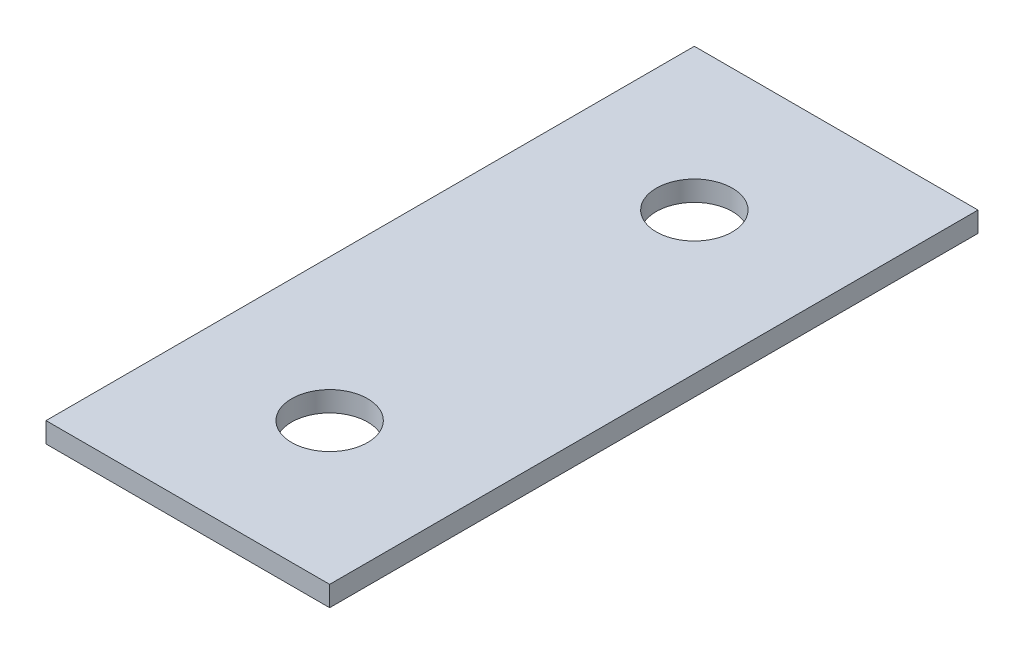
ISO-10303-21;
HEADER;
FILE_DESCRIPTION(('STEP AP214'),'2;1');
FILE_NAME('part.step','',(''),(''),'','','');
FILE_SCHEMA(('AUTOMOTIVE_DESIGN { 1 0 10303 214 1 1 1 1 }'));
ENDSEC;
DATA;
#1=APPLICATION_CONTEXT('core data for automotive mechanical design processes');
#2=APPLICATION_PROTOCOL_DEFINITION('international standard','automotive_design',2000,#1);
#3=PRODUCT_CONTEXT('',#1,'mechanical');
#4=PRODUCT('Part','Part','',(#3));
#5=PRODUCT_RELATED_PRODUCT_CATEGORY('part','',(#4));
#6=PRODUCT_DEFINITION_FORMATION('','',#4);
#7=PRODUCT_DEFINITION_CONTEXT('part definition',#1,'design');
#8=PRODUCT_DEFINITION('design','',#6,#7);
#9=PRODUCT_DEFINITION_SHAPE('','',#8);
#10=(LENGTH_UNIT() NAMED_UNIT(*) SI_UNIT(.MILLI.,.METRE.));
#11=(NAMED_UNIT(*) PLANE_ANGLE_UNIT() SI_UNIT($,.RADIAN.));
#12=(NAMED_UNIT(*) SI_UNIT($,.STERADIAN.) SOLID_ANGLE_UNIT());
#13=UNCERTAINTY_MEASURE_WITH_UNIT(LENGTH_MEASURE(1.E-05),#10,'distance_accuracy_value','');
#14=(GEOMETRIC_REPRESENTATION_CONTEXT(3) GLOBAL_UNCERTAINTY_ASSIGNED_CONTEXT((#13)) GLOBAL_UNIT_ASSIGNED_CONTEXT((#10,
#11,#12)) REPRESENTATION_CONTEXT('',''));
#15=CARTESIAN_POINT('',(0.,0.,0.));
#16=DIRECTION('',(0.,0.,1.));
#17=DIRECTION('',(1.,0.,0.));
#18=AXIS2_PLACEMENT_3D('',#15,#16,#17);
#19=CARTESIAN_POINT('',(0.,6.35,0.));
#20=DIRECTION('',(0.,-1.,0.));
#21=DIRECTION('',(0.,0.,-1.));
#22=AXIS2_PLACEMENT_3D('',#19,#20,#21);
#23=PLANE('',#22);
#24=DIRECTION('',(0.,0.,1.));
#25=VECTOR('',#24,1.);
#26=CARTESIAN_POINT('',(0.,6.35,0.));
#27=LINE('',#26,#25);
#28=CARTESIAN_POINT('',(0.,6.35,-203.2));
#29=VERTEX_POINT('',#28);
#30=CARTESIAN_POINT('',(0.,6.35,0.));
#31=VERTEX_POINT('',#30);
#32=EDGE_CURVE('E94',#29,#31,#27,.T.);
#33=ORIENTED_EDGE('',*,*,#32,.T.);
#34=DIRECTION('',(1.,0.,0.));
#35=VECTOR('',#34,1.);
#36=CARTESIAN_POINT('',(0.,6.35,0.));
#37=LINE('',#36,#35);
#38=CARTESIAN_POINT('',(88.9,6.35,0.));
#39=VERTEX_POINT('',#38);
#40=EDGE_CURVE('E89',#31,#39,#37,.T.);
#41=ORIENTED_EDGE('',*,*,#40,.T.);
#42=DIRECTION('',(0.,0.,-1.));
#43=VECTOR('',#42,1.);
#44=CARTESIAN_POINT('',(88.9,6.35,0.));
#45=LINE('',#44,#43);
#46=CARTESIAN_POINT('',(88.9,6.35,-203.2));
#47=VERTEX_POINT('',#46);
#48=EDGE_CURVE('E92',#39,#47,#45,.T.);
#49=ORIENTED_EDGE('',*,*,#48,.T.);
#50=DIRECTION('',(-1.,0.,0.));
#51=VECTOR('',#50,1.);
#52=CARTESIAN_POINT('',(0.,6.35,-203.2));
#53=LINE('',#52,#51);
#54=EDGE_CURVE('E59',#47,#29,#53,.T.);
#55=ORIENTED_EDGE('',*,*,#54,.T.);
#56=EDGE_LOOP('',(#33,#41,#49,#55));
#57=FACE_BOUND('',#56,.T.);
#58=CARTESIAN_POINT('',(44.45,6.35,-158.75));
#59=DIRECTION('',(0.,1.,0.));
#60=DIRECTION('',(0.,0.,1.));
#61=AXIS2_PLACEMENT_3D('',#58,#59,#60);
#62=CIRCLE('',#61,11.90625);
#63=CARTESIAN_POINT('',(44.45,6.35,-146.84375));
#64=VERTEX_POINT('',#63);
#65=EDGE_CURVE('E116',#64,#64,#62,.T.);
#66=ORIENTED_EDGE('',*,*,#65,.F.);
#67=EDGE_LOOP('',(#66));
#68=FACE_BOUND('',#67,.T.);
#69=CARTESIAN_POINT('',(44.45,6.35,-44.45));
#70=DIRECTION('',(0.,1.,0.));
#71=DIRECTION('',(0.,0.,1.));
#72=AXIS2_PLACEMENT_3D('',#69,#70,#71);
#73=CIRCLE('',#72,11.90625);
#74=CARTESIAN_POINT('',(44.45,6.35,-32.54375));
#75=VERTEX_POINT('',#74);
#76=EDGE_CURVE('E142',#75,#75,#73,.T.);
#77=ORIENTED_EDGE('',*,*,#76,.F.);
#78=EDGE_LOOP('',(#77));
#79=FACE_BOUND('',#78,.T.);
#80=ADVANCED_FACE('F41',(#57,#68,#79),#23,.F.);
#81=CARTESIAN_POINT('',(0.,0.,0.));
#82=DIRECTION('',(0.,-1.,0.));
#83=DIRECTION('',(0.,0.,-1.));
#84=AXIS2_PLACEMENT_3D('',#81,#82,#83);
#85=PLANE('',#84);
#86=CARTESIAN_POINT('',(44.45,0.,-158.75));
#87=DIRECTION('',(0.,1.,0.));
#88=DIRECTION('',(0.,0.,1.));
#89=AXIS2_PLACEMENT_3D('',#86,#87,#88);
#90=CIRCLE('',#89,11.90625);
#91=CARTESIAN_POINT('',(44.45,0.,-146.84375));
#92=VERTEX_POINT('',#91);
#93=EDGE_CURVE('E138',#92,#92,#90,.T.);
#94=ORIENTED_EDGE('',*,*,#93,.T.);
#95=EDGE_LOOP('',(#94));
#96=FACE_BOUND('',#95,.T.);
#97=DIRECTION('',(0.,0.,1.));
#98=VECTOR('',#97,1.);
#99=CARTESIAN_POINT('',(0.,0.,0.));
#100=LINE('',#99,#98);
#101=CARTESIAN_POINT('',(0.,0.,-203.2));
#102=VERTEX_POINT('',#101);
#103=CARTESIAN_POINT('',(0.,0.,0.));
#104=VERTEX_POINT('',#103);
#105=EDGE_CURVE('E112',#102,#104,#100,.T.);
#106=ORIENTED_EDGE('',*,*,#105,.F.);
#107=DIRECTION('',(-1.,0.,0.));
#108=VECTOR('',#107,1.);
#109=CARTESIAN_POINT('',(0.,0.,-203.2));
#110=LINE('',#109,#108);
#111=CARTESIAN_POINT('',(88.9,0.,-203.2));
#112=VERTEX_POINT('',#111);
#113=EDGE_CURVE('E82',#112,#102,#110,.T.);
#114=ORIENTED_EDGE('',*,*,#113,.F.);
#115=DIRECTION('',(0.,0.,-1.));
#116=VECTOR('',#115,1.);
#117=CARTESIAN_POINT('',(88.9,0.,0.));
#118=LINE('',#117,#116);
#119=CARTESIAN_POINT('',(88.9,0.,0.));
#120=VERTEX_POINT('',#119);
#121=EDGE_CURVE('E76',#120,#112,#118,.T.);
#122=ORIENTED_EDGE('',*,*,#121,.F.);
#123=DIRECTION('',(1.,0.,0.));
#124=VECTOR('',#123,1.);
#125=CARTESIAN_POINT('',(0.,0.,0.));
#126=LINE('',#125,#124);
#127=EDGE_CURVE('E99',#104,#120,#126,.T.);
#128=ORIENTED_EDGE('',*,*,#127,.F.);
#129=EDGE_LOOP('',(#106,#114,#122,#128));
#130=FACE_BOUND('',#129,.T.);
#131=CARTESIAN_POINT('',(44.45,0.,-44.45));
#132=DIRECTION('',(0.,1.,0.));
#133=DIRECTION('',(0.,0.,1.));
#134=AXIS2_PLACEMENT_3D('',#131,#132,#133);
#135=CIRCLE('',#134,11.90625);
#136=CARTESIAN_POINT('',(44.45,0.,-32.54375));
#137=VERTEX_POINT('',#136);
#138=EDGE_CURVE('E146',#137,#137,#135,.T.);
#139=ORIENTED_EDGE('',*,*,#138,.T.);
#140=EDGE_LOOP('',(#139));
#141=FACE_BOUND('',#140,.T.);
#142=ADVANCED_FACE('F131',(#96,#130,#141),#85,.T.);
#143=CARTESIAN_POINT('',(0.,6.35,0.));
#144=DIRECTION('',(1.,0.,0.));
#145=DIRECTION('',(0.,0.,-1.));
#146=AXIS2_PLACEMENT_3D('',#143,#144,#145);
#147=PLANE('',#146);
#148=ORIENTED_EDGE('',*,*,#105,.T.);
#149=DIRECTION('',(0.,-1.,0.));
#150=VECTOR('',#149,1.);
#151=CARTESIAN_POINT('',(0.,6.35,0.));
#152=LINE('',#151,#150);
#153=EDGE_CURVE('E11',#31,#104,#152,.T.);
#154=ORIENTED_EDGE('',*,*,#153,.F.);
#155=ORIENTED_EDGE('',*,*,#32,.F.);
#156=DIRECTION('',(0.,-1.,0.));
#157=VECTOR('',#156,1.);
#158=CARTESIAN_POINT('',(0.,6.35,-203.2));
#159=LINE('',#158,#157);
#160=EDGE_CURVE('E108',#29,#102,#159,.T.);
#161=ORIENTED_EDGE('',*,*,#160,.T.);
#162=EDGE_LOOP('',(#148,#154,#155,#161));
#163=FACE_BOUND('',#162,.T.);
#164=ADVANCED_FACE('F43',(#163),#147,.F.);
#165=CARTESIAN_POINT('',(0.,6.35,0.));
#166=DIRECTION('',(0.,0.,-1.));
#167=DIRECTION('',(-1.,0.,0.));
#168=AXIS2_PLACEMENT_3D('',#165,#166,#167);
#169=PLANE('',#168);
#170=ORIENTED_EDGE('',*,*,#127,.T.);
#171=DIRECTION('',(0.,-1.,0.));
#172=VECTOR('',#171,1.);
#173=CARTESIAN_POINT('',(88.9,6.35,0.));
#174=LINE('',#173,#172);
#175=EDGE_CURVE('E51',#39,#120,#174,.T.);
#176=ORIENTED_EDGE('',*,*,#175,.F.);
#177=ORIENTED_EDGE('',*,*,#40,.F.);
#178=ORIENTED_EDGE('',*,*,#153,.T.);
#179=EDGE_LOOP('',(#170,#176,#177,#178));
#180=FACE_BOUND('',#179,.T.);
#181=ADVANCED_FACE('F98',(#180),#169,.F.);
#182=CARTESIAN_POINT('',(88.9,6.35,0.));
#183=DIRECTION('',(-1.,0.,0.));
#184=DIRECTION('',(0.,0.,1.));
#185=AXIS2_PLACEMENT_3D('',#182,#183,#184);
#186=PLANE('',#185);
#187=ORIENTED_EDGE('',*,*,#121,.T.);
#188=DIRECTION('',(0.,-1.,0.));
#189=VECTOR('',#188,1.);
#190=CARTESIAN_POINT('',(88.9,6.35,-203.2));
#191=LINE('',#190,#189);
#192=EDGE_CURVE('E101',#47,#112,#191,.T.);
#193=ORIENTED_EDGE('',*,*,#192,.F.);
#194=ORIENTED_EDGE('',*,*,#48,.F.);
#195=ORIENTED_EDGE('',*,*,#175,.T.);
#196=EDGE_LOOP('',(#187,#193,#194,#195));
#197=FACE_BOUND('',#196,.T.);
#198=ADVANCED_FACE('F102',(#197),#186,.F.);
#199=CARTESIAN_POINT('',(0.,6.35,-203.2));
#200=DIRECTION('',(0.,0.,1.));
#201=DIRECTION('',(1.,0.,0.));
#202=AXIS2_PLACEMENT_3D('',#199,#200,#201);
#203=PLANE('',#202);
#204=ORIENTED_EDGE('',*,*,#113,.T.);
#205=ORIENTED_EDGE('',*,*,#160,.F.);
#206=ORIENTED_EDGE('',*,*,#54,.F.);
#207=ORIENTED_EDGE('',*,*,#192,.T.);
#208=EDGE_LOOP('',(#204,#205,#206,#207));
#209=FACE_BOUND('',#208,.T.);
#210=ADVANCED_FACE('F128',(#209),#203,.F.);
#211=CARTESIAN_POINT('',(44.45,6.35,-158.75));
#212=DIRECTION('',(0.,-1.,0.));
#213=DIRECTION('',(0.,0.,-1.));
#214=AXIS2_PLACEMENT_3D('',#211,#212,#213);
#215=CYLINDRICAL_SURFACE('',#214,11.90625);
#216=ORIENTED_EDGE('',*,*,#65,.T.);
#217=EDGE_LOOP('',(#216));
#218=FACE_BOUND('',#217,.T.);
#219=ORIENTED_EDGE('',*,*,#93,.F.);
#220=EDGE_LOOP('',(#219));
#221=FACE_BOUND('',#220,.T.);
#222=ADVANCED_FACE('F167',(#218,#221),#215,.F.);
#223=CARTESIAN_POINT('',(44.45,6.35,-44.45));
#224=DIRECTION('',(0.,-1.,0.));
#225=DIRECTION('',(0.,0.,-1.));
#226=AXIS2_PLACEMENT_3D('',#223,#224,#225);
#227=CYLINDRICAL_SURFACE('',#226,11.90625);
#228=ORIENTED_EDGE('',*,*,#76,.T.);
#229=EDGE_LOOP('',(#228));
#230=FACE_BOUND('',#229,.T.);
#231=ORIENTED_EDGE('',*,*,#138,.F.);
#232=EDGE_LOOP('',(#231));
#233=FACE_BOUND('',#232,.T.);
#234=ADVANCED_FACE('F156',(#230,#233),#227,.F.);
#235=CLOSED_SHELL('',(#80,#142,#164,#181,#198,#210,#222,#234));
#236=MANIFOLD_SOLID_BREP('B2',#235);
#237=ADVANCED_BREP_SHAPE_REPRESENTATION('',(#18,#236),#14);
#238=SHAPE_DEFINITION_REPRESENTATION(#9,#237);
ENDSEC;
END-ISO-10303-21;
